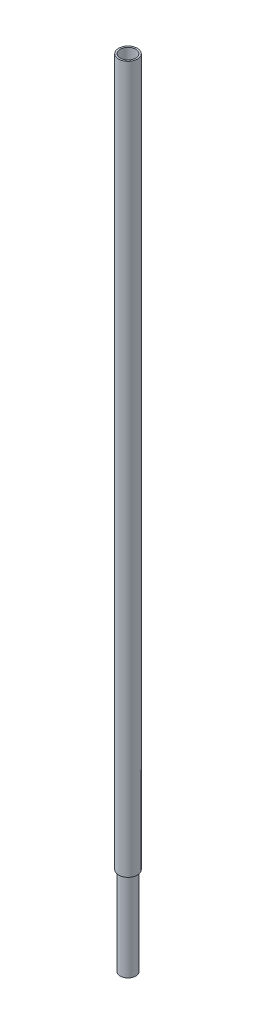
ISO-10303-21;
HEADER;
FILE_DESCRIPTION(('STEP AP214'),'2;1');
FILE_NAME('part.step','',(''),(''),'','','');
FILE_SCHEMA(('AUTOMOTIVE_DESIGN { 1 0 10303 214 1 1 1 1 }'));
ENDSEC;
DATA;
#1=APPLICATION_CONTEXT('core data for automotive mechanical design processes');
#2=APPLICATION_PROTOCOL_DEFINITION('international standard','automotive_design',2000,#1);
#3=PRODUCT_CONTEXT('',#1,'mechanical');
#4=PRODUCT('Part','Part','',(#3));
#5=PRODUCT_RELATED_PRODUCT_CATEGORY('part','',(#4));
#6=PRODUCT_DEFINITION_FORMATION('','',#4);
#7=PRODUCT_DEFINITION_CONTEXT('part definition',#1,'design');
#8=PRODUCT_DEFINITION('design','',#6,#7);
#9=PRODUCT_DEFINITION_SHAPE('','',#8);
#10=(LENGTH_UNIT() NAMED_UNIT(*) SI_UNIT(.MILLI.,.METRE.));
#11=(NAMED_UNIT(*) PLANE_ANGLE_UNIT() SI_UNIT($,.RADIAN.));
#12=(NAMED_UNIT(*) SI_UNIT($,.STERADIAN.) SOLID_ANGLE_UNIT());
#13=UNCERTAINTY_MEASURE_WITH_UNIT(LENGTH_MEASURE(1.E-05),#10,'distance_accuracy_value','');
#14=(GEOMETRIC_REPRESENTATION_CONTEXT(3) GLOBAL_UNCERTAINTY_ASSIGNED_CONTEXT((#13)) GLOBAL_UNIT_ASSIGNED_CONTEXT((#10,
#11,#12)) REPRESENTATION_CONTEXT('',''));
#15=CARTESIAN_POINT('',(0.,0.,0.));
#16=DIRECTION('',(0.,0.,1.));
#17=DIRECTION('',(1.,0.,0.));
#18=AXIS2_PLACEMENT_3D('',#15,#16,#17);
#19=CARTESIAN_POINT('',(0.,320.,0.));
#20=DIRECTION('',(0.,-1.,0.));
#21=DIRECTION('',(0.,0.,-1.));
#22=AXIS2_PLACEMENT_3D('',#19,#20,#21);
#23=CYLINDRICAL_SURFACE('',#22,4.25);
#24=CARTESIAN_POINT('',(0.,320.,0.));
#25=DIRECTION('',(0.,1.,0.));
#26=DIRECTION('',(0.,0.,1.));
#27=AXIS2_PLACEMENT_3D('',#24,#25,#26);
#28=CIRCLE('',#27,4.25);
#29=CARTESIAN_POINT('',(0.,320.,4.25));
#30=VERTEX_POINT('',#29);
#31=EDGE_CURVE('E44',#30,#30,#28,.T.);
#32=ORIENTED_EDGE('',*,*,#31,.F.);
#33=EDGE_LOOP('',(#32));
#34=FACE_BOUND('',#33,.T.);
#35=CARTESIAN_POINT('',(0.,0.,0.));
#36=DIRECTION('',(0.,1.,0.));
#37=DIRECTION('',(0.,0.,1.));
#38=AXIS2_PLACEMENT_3D('',#35,#36,#37);
#39=CIRCLE('',#38,4.25);
#40=CARTESIAN_POINT('',(0.,0.,4.25));
#41=VERTEX_POINT('',#40);
#42=EDGE_CURVE('E49',#41,#41,#39,.T.);
#43=ORIENTED_EDGE('',*,*,#42,.T.);
#44=EDGE_LOOP('',(#43));
#45=FACE_BOUND('',#44,.T.);
#46=ADVANCED_FACE('F37',(#34,#45),#23,.T.);
#47=CARTESIAN_POINT('',(0.,320.,0.));
#48=DIRECTION('',(0.,1.,0.));
#49=DIRECTION('',(0.,0.,1.));
#50=AXIS2_PLACEMENT_3D('',#47,#48,#49);
#51=PLANE('',#50);
#52=CARTESIAN_POINT('',(0.,320.,0.));
#53=DIRECTION('',(0.,1.,0.));
#54=DIRECTION('',(0.,0.,1.));
#55=AXIS2_PLACEMENT_3D('',#52,#53,#54);
#56=CIRCLE('',#55,3.5);
#57=CARTESIAN_POINT('',(0.,320.,3.5));
#58=VERTEX_POINT('',#57);
#59=EDGE_CURVE('E55',#58,#58,#56,.F.);
#60=ORIENTED_EDGE('',*,*,#59,.T.);
#61=EDGE_LOOP('',(#60));
#62=FACE_BOUND('',#61,.T.);
#63=ORIENTED_EDGE('',*,*,#31,.T.);
#64=EDGE_LOOP('',(#63));
#65=FACE_BOUND('',#64,.T.);
#66=ADVANCED_FACE('F96',(#62,#65),#51,.T.);
#67=CARTESIAN_POINT('',(0.,0.,0.));
#68=DIRECTION('',(0.,1.,0.));
#69=DIRECTION('',(0.,0.,1.));
#70=AXIS2_PLACEMENT_3D('',#67,#68,#69);
#71=PLANE('',#70);
#72=CARTESIAN_POINT('',(0.,0.,0.));
#73=DIRECTION('',(0.,1.,0.));
#74=DIRECTION('',(0.,0.,1.));
#75=AXIS2_PLACEMENT_3D('',#72,#73,#74);
#76=CIRCLE('',#75,3.5);
#77=CARTESIAN_POINT('',(0.,0.,3.5));
#78=VERTEX_POINT('',#77);
#79=EDGE_CURVE('E60',#78,#78,#76,.F.);
#80=ORIENTED_EDGE('',*,*,#79,.F.);
#81=EDGE_LOOP('',(#80));
#82=FACE_BOUND('',#81,.T.);
#83=ORIENTED_EDGE('',*,*,#42,.F.);
#84=EDGE_LOOP('',(#83));
#85=FACE_BOUND('',#84,.T.);
#86=ADVANCED_FACE('F101',(#82,#85),#71,.F.);
#87=CARTESIAN_POINT('',(0.,494.,0.));
#88=DIRECTION('',(0.,-1.,0.));
#89=DIRECTION('',(0.,0.,-1.));
#90=AXIS2_PLACEMENT_3D('',#87,#88,#89);
#91=CYLINDRICAL_SURFACE('',#90,3.5);
#92=CARTESIAN_POINT('',(0.,40.,0.));
#93=DIRECTION('',(0.,1.,0.));
#94=DIRECTION('',(0.,0.,1.));
#95=AXIS2_PLACEMENT_3D('',#92,#93,#94);
#96=CIRCLE('',#95,3.5);
#97=CARTESIAN_POINT('',(0.,40.,3.5));
#98=VERTEX_POINT('',#97);
#99=EDGE_CURVE('E10',#98,#98,#96,.T.);
#100=ORIENTED_EDGE('',*,*,#99,.F.);
#101=EDGE_LOOP('',(#100));
#102=FACE_BOUND('',#101,.T.);
#103=ORIENTED_EDGE('',*,*,#59,.F.);
#104=EDGE_LOOP('',(#103));
#105=FACE_BOUND('',#104,.T.);
#106=ADVANCED_FACE('F91',(#102,#105),#91,.F.);
#107=CARTESIAN_POINT('',(0.,40.,0.));
#108=DIRECTION('',(0.,-1.,0.));
#109=DIRECTION('',(0.,0.,-1.));
#110=AXIS2_PLACEMENT_3D('',#107,#108,#109);
#111=CYLINDRICAL_SURFACE('',#110,3.5);
#112=CARTESIAN_POINT('',(0.,-40.,0.));
#113=DIRECTION('',(0.,1.,0.));
#114=DIRECTION('',(0.,0.,1.));
#115=AXIS2_PLACEMENT_3D('',#112,#113,#114);
#116=CIRCLE('',#115,3.5);
#117=CARTESIAN_POINT('',(0.,-40.,3.5));
#118=VERTEX_POINT('',#117);
#119=EDGE_CURVE('E64',#118,#118,#116,.T.);
#120=ORIENTED_EDGE('',*,*,#119,.T.);
#121=EDGE_LOOP('',(#120));
#122=FACE_BOUND('',#121,.T.);
#123=ORIENTED_EDGE('',*,*,#79,.T.);
#124=EDGE_LOOP('',(#123));
#125=FACE_BOUND('',#124,.T.);
#126=ADVANCED_FACE('F83',(#122,#125),#111,.T.);
#127=CARTESIAN_POINT('',(0.,40.,0.));
#128=DIRECTION('',(0.,1.,0.));
#129=DIRECTION('',(0.,0.,1.));
#130=AXIS2_PLACEMENT_3D('',#127,#128,#129);
#131=PLANE('',#130);
#132=ORIENTED_EDGE('',*,*,#99,.T.);
#133=EDGE_LOOP('',(#132));
#134=FACE_BOUND('',#133,.T.);
#135=CARTESIAN_POINT('',(0.,40.,0.));
#136=DIRECTION('',(0.,1.,0.));
#137=DIRECTION('',(0.,0.,1.));
#138=AXIS2_PLACEMENT_3D('',#135,#136,#137);
#139=CIRCLE('',#138,2.5);
#140=CARTESIAN_POINT('',(0.,40.,2.5));
#141=VERTEX_POINT('',#140);
#142=EDGE_CURVE('E68',#141,#141,#139,.T.);
#143=ORIENTED_EDGE('',*,*,#142,.F.);
#144=EDGE_LOOP('',(#143));
#145=FACE_BOUND('',#144,.T.);
#146=ADVANCED_FACE('F80',(#134,#145),#131,.T.);
#147=CARTESIAN_POINT('',(0.,-40.,0.));
#148=DIRECTION('',(0.,1.,0.));
#149=DIRECTION('',(0.,0.,1.));
#150=AXIS2_PLACEMENT_3D('',#147,#148,#149);
#151=PLANE('',#150);
#152=ORIENTED_EDGE('',*,*,#119,.F.);
#153=EDGE_LOOP('',(#152));
#154=FACE_BOUND('',#153,.T.);
#155=CARTESIAN_POINT('',(0.,-40.,0.));
#156=DIRECTION('',(0.,1.,0.));
#157=DIRECTION('',(0.,0.,1.));
#158=AXIS2_PLACEMENT_3D('',#155,#156,#157);
#159=CIRCLE('',#158,2.5);
#160=CARTESIAN_POINT('',(0.,-40.,2.5));
#161=VERTEX_POINT('',#160);
#162=EDGE_CURVE('E69',#161,#161,#159,.T.);
#163=ORIENTED_EDGE('',*,*,#162,.T.);
#164=EDGE_LOOP('',(#163));
#165=FACE_BOUND('',#164,.T.);
#166=ADVANCED_FACE('F82',(#154,#165),#151,.F.);
#167=CARTESIAN_POINT('',(0.,40.,0.));
#168=DIRECTION('',(0.,-1.,0.));
#169=DIRECTION('',(0.,0.,-1.));
#170=AXIS2_PLACEMENT_3D('',#167,#168,#169);
#171=CYLINDRICAL_SURFACE('',#170,2.5);
#172=ORIENTED_EDGE('',*,*,#142,.T.);
#173=EDGE_LOOP('',(#172));
#174=FACE_BOUND('',#173,.T.);
#175=ORIENTED_EDGE('',*,*,#162,.F.);
#176=EDGE_LOOP('',(#175));
#177=FACE_BOUND('',#176,.T.);
#178=ADVANCED_FACE('F77',(#174,#177),#171,.F.);
#179=CLOSED_SHELL('',(#46,#66,#86,#106,#126,#146,#166,#178));
#180=MANIFOLD_SOLID_BREP('B2',#179);
#181=ADVANCED_BREP_SHAPE_REPRESENTATION('',(#18,#180),#14);
#182=SHAPE_DEFINITION_REPRESENTATION(#9,#181);
ENDSEC;
END-ISO-10303-21;
